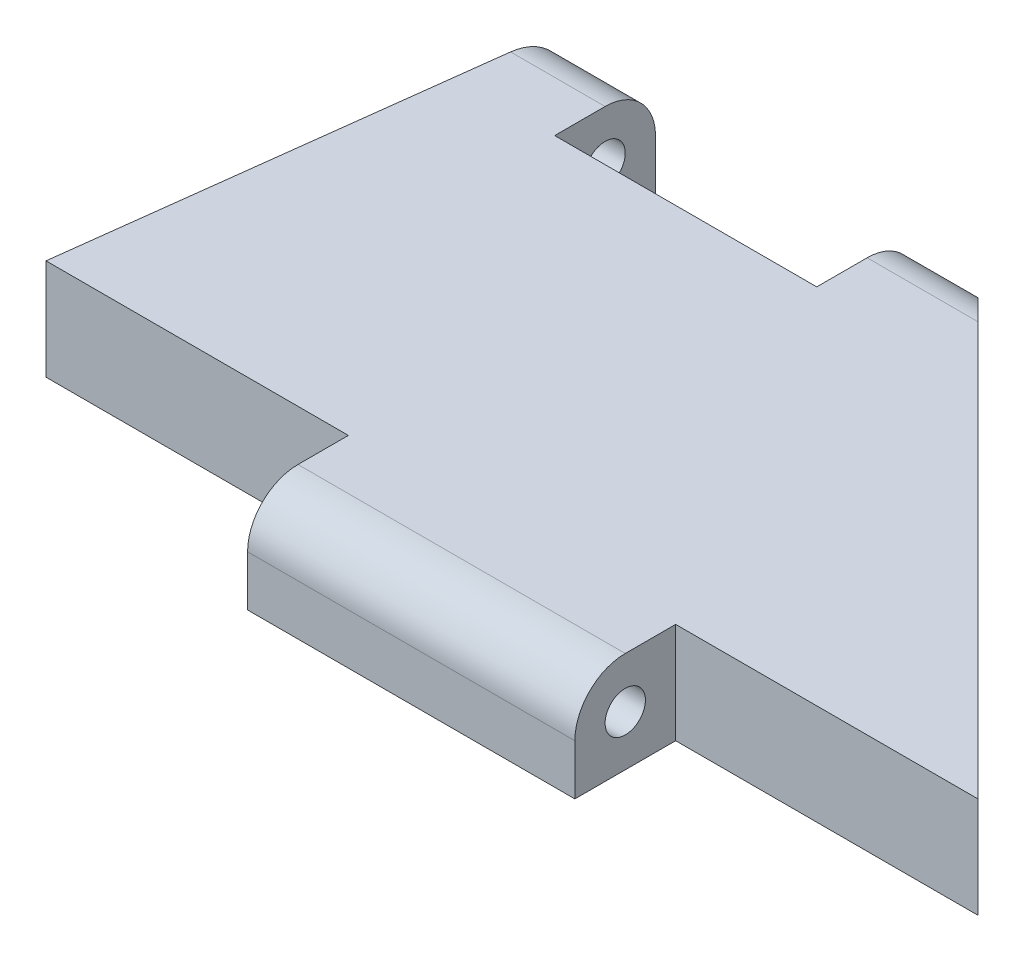
ISO-10303-21;
HEADER;
FILE_DESCRIPTION(('STEP AP214'),'2;1');
FILE_NAME('part.step','',(''),(''),'','','');
FILE_SCHEMA(('AUTOMOTIVE_DESIGN { 1 0 10303 214 1 1 1 1 }'));
ENDSEC;
DATA;
#1=APPLICATION_CONTEXT('core data for automotive mechanical design processes');
#2=APPLICATION_PROTOCOL_DEFINITION('international standard','automotive_design',2000,#1);
#3=PRODUCT_CONTEXT('',#1,'mechanical');
#4=PRODUCT('Part','Part','',(#3));
#5=PRODUCT_RELATED_PRODUCT_CATEGORY('part','',(#4));
#6=PRODUCT_DEFINITION_FORMATION('','',#4);
#7=PRODUCT_DEFINITION_CONTEXT('part definition',#1,'design');
#8=PRODUCT_DEFINITION('design','',#6,#7);
#9=PRODUCT_DEFINITION_SHAPE('','',#8);
#10=(LENGTH_UNIT() NAMED_UNIT(*) SI_UNIT(.MILLI.,.METRE.));
#11=(NAMED_UNIT(*) PLANE_ANGLE_UNIT() SI_UNIT($,.RADIAN.));
#12=(NAMED_UNIT(*) SI_UNIT($,.STERADIAN.) SOLID_ANGLE_UNIT());
#13=UNCERTAINTY_MEASURE_WITH_UNIT(LENGTH_MEASURE(1.E-05),#10,'distance_accuracy_value','');
#14=(GEOMETRIC_REPRESENTATION_CONTEXT(3) GLOBAL_UNCERTAINTY_ASSIGNED_CONTEXT((#13)) GLOBAL_UNIT_ASSIGNED_CONTEXT((#10,
#11,#12)) REPRESENTATION_CONTEXT('',''));
#15=CARTESIAN_POINT('',(0.,0.,0.));
#16=DIRECTION('',(0.,0.,1.));
#17=DIRECTION('',(1.,0.,0.));
#18=AXIS2_PLACEMENT_3D('',#15,#16,#17);
#19=CARTESIAN_POINT('',(-24.13,0.,-48.3095533280841));
#20=DIRECTION('',(0.,0.,-1.));
#21=DIRECTION('',(-1.,0.,0.));
#22=AXIS2_PLACEMENT_3D('',#19,#20,#21);
#23=PLANE('',#22);
#24=DIRECTION('',(1.,0.,0.));
#25=VECTOR('',#24,1.);
#26=CARTESIAN_POINT('',(-24.13,0.,-48.3095533280841));
#27=LINE('',#26,#25);
#28=CARTESIAN_POINT('',(-0.80600935182104,2.46489848294482E-13,-48.309553328084));
#29=VERTEX_POINT('',#28);
#30=CARTESIAN_POINT('',(3.00399064817896,0.,-48.3095533280841));
#31=VERTEX_POINT('',#30);
#32=EDGE_CURVE('E263',#29,#31,#27,.T.);
#33=ORIENTED_EDGE('',*,*,#32,.F.);
#34=DIRECTION('',(0.,-1.,0.));
#35=VECTOR('',#34,1.);
#36=CARTESIAN_POINT('',(-0.80600935182104,-1.08197813299747E-13,-48.309553328084));
#37=LINE('',#36,#35);
#38=CARTESIAN_POINT('',(-0.806009351821049,3.17499999999999,-48.309553328084));
#39=VERTEX_POINT('',#38);
#40=EDGE_CURVE('E242',#39,#29,#37,.T.);
#41=ORIENTED_EDGE('',*,*,#40,.F.);
#42=DIRECTION('',(1.,0.,0.));
#43=VECTOR('',#42,1.);
#44=CARTESIAN_POINT('',(-24.13,3.175,-48.3095533280841));
#45=LINE('',#44,#43);
#46=CARTESIAN_POINT('',(3.00399064817895,3.175,-48.3095533280841));
#47=VERTEX_POINT('',#46);
#48=EDGE_CURVE('E131',#39,#47,#45,.T.);
#49=ORIENTED_EDGE('',*,*,#48,.T.);
#50=DIRECTION('',(0.,1.,0.));
#51=VECTOR('',#50,1.);
#52=CARTESIAN_POINT('',(3.00399064817896,0.,-48.3095533280841));
#53=LINE('',#52,#51);
#54=EDGE_CURVE('E259',#31,#47,#53,.T.);
#55=ORIENTED_EDGE('',*,*,#54,.F.);
#56=EDGE_LOOP('',(#33,#41,#49,#55));
#57=FACE_BOUND('',#56,.T.);
#58=ADVANCED_FACE('F108',(#57),#23,.T.);
#59=CARTESIAN_POINT('',(-24.13,3.175,-45.1345533280841));
#60=DIRECTION('',(1.,0.,0.));
#61=DIRECTION('',(0.,0.,-1.));
#62=AXIS2_PLACEMENT_3D('',#59,#60,#61);
#63=CYLINDRICAL_SURFACE('',#62,3.175);
#64=ORIENTED_EDGE('',*,*,#48,.F.);
#65=CARTESIAN_POINT('',(-0.806009351821027,3.175,-45.1345533280841));
#66=DIRECTION('',(-1.,0.,0.));
#67=DIRECTION('',(0.,0.,1.));
#68=AXIS2_PLACEMENT_3D('',#65,#66,#67);
#69=CIRCLE('',#68,3.175);
#70=CARTESIAN_POINT('',(-0.806009351821006,6.35,-45.1345533280841));
#71=VERTEX_POINT('',#70);
#72=EDGE_CURVE('E116',#39,#71,#69,.F.);
#73=ORIENTED_EDGE('',*,*,#72,.T.);
#74=DIRECTION('',(1.,0.,0.));
#75=VECTOR('',#74,1.);
#76=CARTESIAN_POINT('',(-24.13,6.35,-45.1345533280841));
#77=LINE('',#76,#75);
#78=CARTESIAN_POINT('',(6.17899064817894,6.35,-45.1345533280841));
#79=VERTEX_POINT('',#78);
#80=EDGE_CURVE('E267',#71,#79,#77,.T.);
#81=ORIENTED_EDGE('',*,*,#80,.T.);
#82=CARTESIAN_POINT('',(6.17899064817895,3.175,-45.1345533280841));
#83=DIRECTION('',(-0.707106781186548,0.,0.707106781186547));
#84=DIRECTION('',(0.707106781186547,0.,0.707106781186548));
#85=AXIS2_PLACEMENT_3D('',#82,#83,#84);
#86=ELLIPSE('',#85,4.49012806053457,3.175);
#87=EDGE_CURVE('E338',#47,#79,#86,.F.);
#88=ORIENTED_EDGE('',*,*,#87,.F.);
#89=EDGE_LOOP('',(#64,#73,#81,#88));
#90=FACE_BOUND('',#89,.T.);
#91=ADVANCED_FACE('F342',(#90),#63,.T.);
#92=CARTESIAN_POINT('',(0.,6.35,0.));
#93=DIRECTION('',(0.,1.,0.));
#94=DIRECTION('',(0.,0.,1.));
#95=AXIS2_PLACEMENT_3D('',#92,#93,#94);
#96=PLANE('',#95);
#97=DIRECTION('',(0.,0.,-1.));
#98=VECTOR('',#97,1.);
#99=CARTESIAN_POINT('',(-17.3160093518207,6.34999999999988,1.06992989888327E-13));
#100=LINE('',#99,#98);
#101=CARTESIAN_POINT('',(-17.316009351821,6.34999999999979,-41.9595533280843));
#102=VERTEX_POINT('',#101);
#103=CARTESIAN_POINT('',(-17.316009351821,6.34999999999978,-45.1345533280841));
#104=VERTEX_POINT('',#103);
#105=EDGE_CURVE('E236',#102,#104,#100,.T.);
#106=ORIENTED_EDGE('',*,*,#105,.T.);
#107=CARTESIAN_POINT('',(-23.2715070293211,6.35,-45.1345533280841));
#108=VERTEX_POINT('',#107);
#109=EDGE_CURVE('E264',#108,#104,#77,.T.);
#110=ORIENTED_EDGE('',*,*,#109,.F.);
#111=DIRECTION('',(-0.123304512929953,0.,0.99236888156124));
#112=VECTOR('',#111,1.);
#113=CARTESIAN_POINT('',(-23.6660093518211,6.35,-41.9595533280841));
#114=LINE('',#113,#112);
#115=CARTESIAN_POINT('',(-26.5064260738208,6.35,-19.0995533280841));
#116=VERTEX_POINT('',#115);
#117=EDGE_CURVE('E320',#108,#116,#114,.T.);
#118=ORIENTED_EDGE('',*,*,#117,.T.);
#119=DIRECTION('',(-1.,0.,0.));
#120=VECTOR('',#119,1.);
#121=CARTESIAN_POINT('',(-7.4564260738208,6.35,-19.0995533280841));
#122=LINE('',#121,#120);
#123=CARTESIAN_POINT('',(-7.4564260738208,6.35,-19.0995533280841));
#124=VERTEX_POINT('',#123);
#125=EDGE_CURVE('E286',#124,#116,#122,.T.);
#126=ORIENTED_EDGE('',*,*,#125,.F.);
#127=DIRECTION('',(0.,0.,-1.));
#128=VECTOR('',#127,1.);
#129=CARTESIAN_POINT('',(-7.4564260738208,6.35,0.));
#130=LINE('',#129,#128);
#131=CARTESIAN_POINT('',(-7.4564260738208,6.35,-15.9245533280841));
#132=VERTEX_POINT('',#131);
#133=EDGE_CURVE('E273',#132,#124,#130,.T.);
#134=ORIENTED_EDGE('',*,*,#133,.F.);
#135=DIRECTION('',(-1.,0.,0.));
#136=VECTOR('',#135,1.);
#137=CARTESIAN_POINT('',(32.2139906481792,6.35,-15.9245533280841));
#138=LINE('',#137,#136);
#139=CARTESIAN_POINT('',(13.1639906481792,6.35,-15.9245533280841));
#140=VERTEX_POINT('',#139);
#141=EDGE_CURVE('E316',#140,#132,#138,.T.);
#142=ORIENTED_EDGE('',*,*,#141,.F.);
#143=DIRECTION('',(0.,0.,1.));
#144=VECTOR('',#143,1.);
#145=CARTESIAN_POINT('',(13.1639906481792,6.35,0.));
#146=LINE('',#145,#144);
#147=CARTESIAN_POINT('',(13.1639906481792,6.35,-19.0995533280841));
#148=VERTEX_POINT('',#147);
#149=EDGE_CURVE('E294',#148,#140,#146,.T.);
#150=ORIENTED_EDGE('',*,*,#149,.F.);
#151=DIRECTION('',(1.,0.,0.));
#152=VECTOR('',#151,1.);
#153=CARTESIAN_POINT('',(13.1639906481792,6.35,-19.0995533280841));
#154=LINE('',#153,#152);
#155=CARTESIAN_POINT('',(32.2139906481792,6.35,-19.0995533280841));
#156=VERTEX_POINT('',#155);
#157=EDGE_CURVE('E306',#148,#156,#154,.T.);
#158=ORIENTED_EDGE('',*,*,#157,.T.);
#159=DIRECTION('',(-0.707106781186551,0.,-0.707106781186544));
#160=VECTOR('',#159,1.);
#161=CARTESIAN_POINT('',(32.2139906481792,6.35,-19.0995533280841));
#162=LINE('',#161,#160);
#163=EDGE_CURVE('E323',#156,#79,#162,.T.);
#164=ORIENTED_EDGE('',*,*,#163,.T.);
#165=ORIENTED_EDGE('',*,*,#80,.F.);
#166=DIRECTION('',(0.,0.,-1.));
#167=VECTOR('',#166,1.);
#168=CARTESIAN_POINT('',(-0.806009351820723,6.34999999999994,0.));
#169=LINE('',#168,#167);
#170=CARTESIAN_POINT('',(-0.806009351821016,6.34999999999984,-41.9595533280844));
#171=VERTEX_POINT('',#170);
#172=EDGE_CURVE('E123',#171,#71,#169,.T.);
#173=ORIENTED_EDGE('',*,*,#172,.F.);
#174=DIRECTION('',(1.,0.,0.));
#175=VECTOR('',#174,1.);
#176=CARTESIAN_POINT('',(-17.316009351821,6.34999999999979,-41.9595533280843));
#177=LINE('',#176,#175);
#178=EDGE_CURVE('E228',#102,#171,#177,.T.);
#179=ORIENTED_EDGE('',*,*,#178,.F.);
#180=EDGE_LOOP('',(#106,#110,#118,#126,#134,#142,#150,#158,#164,#165,#173,#179));
#181=FACE_BOUND('',#180,.T.);
#182=ADVANCED_FACE('F345',(#181),#96,.T.);
#183=CARTESIAN_POINT('',(0.,0.,0.));
#184=DIRECTION('',(0.,1.,0.));
#185=DIRECTION('',(0.,0.,1.));
#186=AXIS2_PLACEMENT_3D('',#183,#184,#185);
#187=PLANE('',#186);
#188=CARTESIAN_POINT('',(-22.8770047068211,0.,-48.3095533280841));
#189=VERTEX_POINT('',#188);
#190=CARTESIAN_POINT('',(-17.316009351821,1.92366475844006E-13,-48.3095533280839));
#191=VERTEX_POINT('',#190);
#192=EDGE_CURVE('E241',#189,#191,#27,.T.);
#193=ORIENTED_EDGE('',*,*,#192,.T.);
#194=DIRECTION('',(0.,0.,-1.));
#195=VECTOR('',#194,1.);
#196=CARTESIAN_POINT('',(-17.3160093518207,0.,1.20870777696142E-13));
#197=LINE('',#196,#195);
#198=CARTESIAN_POINT('',(-17.316009351821,2.06244263651821E-13,-41.9595533280843));
#199=VERTEX_POINT('',#198);
#200=EDGE_CURVE('E233',#199,#191,#197,.T.);
#201=ORIENTED_EDGE('',*,*,#200,.F.);
#202=DIRECTION('',(1.,0.,0.));
#203=VECTOR('',#202,1.);
#204=CARTESIAN_POINT('',(-17.316009351821,2.06244263651821E-13,-41.9595533280843));
#205=LINE('',#204,#203);
#206=CARTESIAN_POINT('',(-0.806009351820995,2.60367636102297E-13,-41.9595533280844));
#207=VERTEX_POINT('',#206);
#208=EDGE_CURVE('E218',#199,#207,#205,.T.);
#209=ORIENTED_EDGE('',*,*,#208,.T.);
#210=DIRECTION('',(0.,0.,-1.));
#211=VECTOR('',#210,1.);
#212=CARTESIAN_POINT('',(-0.806009351820702,0.,0.));
#213=LINE('',#212,#211);
#214=EDGE_CURVE('E252',#207,#29,#213,.T.);
#215=ORIENTED_EDGE('',*,*,#214,.T.);
#216=ORIENTED_EDGE('',*,*,#32,.T.);
#217=DIRECTION('',(-0.707106781186551,0.,-0.707106781186544));
#218=VECTOR('',#217,1.);
#219=CARTESIAN_POINT('',(32.2139906481792,0.,-19.0995533280841));
#220=LINE('',#219,#218);
#221=CARTESIAN_POINT('',(32.2139906481792,0.,-19.0995533280841));
#222=VERTEX_POINT('',#221);
#223=EDGE_CURVE('E324',#222,#31,#220,.T.);
#224=ORIENTED_EDGE('',*,*,#223,.F.);
#225=DIRECTION('',(1.,0.,0.));
#226=VECTOR('',#225,1.);
#227=CARTESIAN_POINT('',(13.1639906481792,0.,-19.0995533280841));
#228=LINE('',#227,#226);
#229=CARTESIAN_POINT('',(13.1639906481792,0.,-19.0995533280841));
#230=VERTEX_POINT('',#229);
#231=EDGE_CURVE('E305',#230,#222,#228,.T.);
#232=ORIENTED_EDGE('',*,*,#231,.F.);
#233=DIRECTION('',(0.,0.,1.));
#234=VECTOR('',#233,1.);
#235=CARTESIAN_POINT('',(13.1639906481792,0.,0.));
#236=LINE('',#235,#234);
#237=CARTESIAN_POINT('',(13.1639906481792,0.,-12.7495533280841));
#238=VERTEX_POINT('',#237);
#239=EDGE_CURVE('E300',#230,#238,#236,.T.);
#240=ORIENTED_EDGE('',*,*,#239,.T.);
#241=DIRECTION('',(-1.,0.,0.));
#242=VECTOR('',#241,1.);
#243=CARTESIAN_POINT('',(32.2139906481792,0.,-12.7495533280841));
#244=LINE('',#243,#242);
#245=CARTESIAN_POINT('',(-7.4564260738208,0.,-12.7495533280841));
#246=VERTEX_POINT('',#245);
#247=EDGE_CURVE('E309',#238,#246,#244,.T.);
#248=ORIENTED_EDGE('',*,*,#247,.T.);
#249=DIRECTION('',(0.,0.,-1.));
#250=VECTOR('',#249,1.);
#251=CARTESIAN_POINT('',(-7.4564260738208,0.,0.));
#252=LINE('',#251,#250);
#253=CARTESIAN_POINT('',(-7.4564260738208,0.,-19.0995533280841));
#254=VERTEX_POINT('',#253);
#255=EDGE_CURVE('E278',#246,#254,#252,.T.);
#256=ORIENTED_EDGE('',*,*,#255,.T.);
#257=DIRECTION('',(-1.,0.,0.));
#258=VECTOR('',#257,1.);
#259=CARTESIAN_POINT('',(-7.4564260738208,0.,-19.0995533280841));
#260=LINE('',#259,#258);
#261=CARTESIAN_POINT('',(-26.5064260738208,0.,-19.0995533280841));
#262=VERTEX_POINT('',#261);
#263=EDGE_CURVE('E287',#254,#262,#260,.T.);
#264=ORIENTED_EDGE('',*,*,#263,.T.);
#265=DIRECTION('',(-0.123304512929953,0.,0.99236888156124));
#266=VECTOR('',#265,1.);
#267=CARTESIAN_POINT('',(-23.6660093518211,0.,-41.9595533280841));
#268=LINE('',#267,#266);
#269=EDGE_CURVE('E319',#189,#262,#268,.T.);
#270=ORIENTED_EDGE('',*,*,#269,.F.);
#271=EDGE_LOOP('',(#193,#201,#209,#215,#216,#224,#232,#240,#248,#256,#264,#270));
#272=FACE_BOUND('',#271,.T.);
#273=ADVANCED_FACE('F239',(#272),#187,.F.);
#274=CARTESIAN_POINT('',(32.2139906481792,3.175,-15.9245533280841));
#275=DIRECTION('',(-1.,0.,0.));
#276=DIRECTION('',(0.,0.,1.));
#277=AXIS2_PLACEMENT_3D('',#274,#275,#276);
#278=CYLINDRICAL_SURFACE('',#277,3.175);
#279=ORIENTED_EDGE('',*,*,#141,.T.);
#280=CARTESIAN_POINT('',(-7.4564260738208,3.175,-15.9245533280841));
#281=DIRECTION('',(1.,0.,0.));
#282=DIRECTION('',(0.,0.,-1.));
#283=AXIS2_PLACEMENT_3D('',#280,#281,#282);
#284=CIRCLE('',#283,3.175);
#285=CARTESIAN_POINT('',(-7.4564260738208,3.175,-12.7495533280841));
#286=VERTEX_POINT('',#285);
#287=EDGE_CURVE('E283',#132,#286,#284,.T.);
#288=ORIENTED_EDGE('',*,*,#287,.T.);
#289=DIRECTION('',(-1.,0.,0.));
#290=VECTOR('',#289,1.);
#291=CARTESIAN_POINT('',(32.2139906481792,3.175,-12.7495533280841));
#292=LINE('',#291,#290);
#293=CARTESIAN_POINT('',(13.1639906481792,3.175,-12.7495533280841));
#294=VERTEX_POINT('',#293);
#295=EDGE_CURVE('E313',#294,#286,#292,.T.);
#296=ORIENTED_EDGE('',*,*,#295,.F.);
#297=CARTESIAN_POINT('',(13.1639906481792,3.175,-15.9245533280841));
#298=DIRECTION('',(1.,0.,0.));
#299=DIRECTION('',(0.,0.,-1.));
#300=AXIS2_PLACEMENT_3D('',#297,#298,#299);
#301=CIRCLE('',#300,3.175);
#302=EDGE_CURVE('E296',#140,#294,#301,.T.);
#303=ORIENTED_EDGE('',*,*,#302,.F.);
#304=EDGE_LOOP('',(#279,#288,#296,#303));
#305=FACE_BOUND('',#304,.T.);
#306=ADVANCED_FACE('F408',(#305),#278,.T.);
#307=CARTESIAN_POINT('',(32.2139906481792,0.,-12.7495533280841));
#308=DIRECTION('',(0.,0.,1.));
#309=DIRECTION('',(1.,0.,0.));
#310=AXIS2_PLACEMENT_3D('',#307,#308,#309);
#311=PLANE('',#310);
#312=DIRECTION('',(0.,1.,0.));
#313=VECTOR('',#312,1.);
#314=CARTESIAN_POINT('',(-7.4564260738208,0.,-12.7495533280841));
#315=LINE('',#314,#313);
#316=EDGE_CURVE('E281',#246,#286,#315,.T.);
#317=ORIENTED_EDGE('',*,*,#316,.F.);
#318=ORIENTED_EDGE('',*,*,#247,.F.);
#319=DIRECTION('',(0.,-1.,0.));
#320=VECTOR('',#319,1.);
#321=CARTESIAN_POINT('',(13.1639906481792,0.,-12.7495533280841));
#322=LINE('',#321,#320);
#323=EDGE_CURVE('E298',#294,#238,#322,.T.);
#324=ORIENTED_EDGE('',*,*,#323,.F.);
#325=ORIENTED_EDGE('',*,*,#295,.T.);
#326=EDGE_LOOP('',(#317,#318,#324,#325));
#327=FACE_BOUND('',#326,.T.);
#328=ADVANCED_FACE('F403',(#327),#311,.T.);
#329=CARTESIAN_POINT('',(32.2139906481792,3.175,-15.9245533280841));
#330=DIRECTION('',(-1.,0.,0.));
#331=DIRECTION('',(0.,0.,1.));
#332=AXIS2_PLACEMENT_3D('',#329,#330,#331);
#333=CYLINDRICAL_SURFACE('',#332,1.27);
#334=CARTESIAN_POINT('',(-7.4564260738208,3.175,-15.9245533280841));
#335=DIRECTION('',(1.,0.,0.));
#336=DIRECTION('',(0.,0.,-1.));
#337=AXIS2_PLACEMENT_3D('',#334,#335,#336);
#338=CIRCLE('',#337,1.27);
#339=CARTESIAN_POINT('',(-7.4564260738208,3.175,-17.1945533280841));
#340=VERTEX_POINT('',#339);
#341=EDGE_CURVE('E262',#340,#340,#338,.T.);
#342=ORIENTED_EDGE('',*,*,#341,.F.);
#343=EDGE_LOOP('',(#342));
#344=FACE_BOUND('',#343,.T.);
#345=CARTESIAN_POINT('',(13.1639906481792,3.175,-15.9245533280841));
#346=DIRECTION('',(1.,0.,0.));
#347=DIRECTION('',(0.,0.,-1.));
#348=AXIS2_PLACEMENT_3D('',#345,#346,#347);
#349=CIRCLE('',#348,1.27);
#350=CARTESIAN_POINT('',(13.1639906481792,3.175,-17.1945533280841));
#351=VERTEX_POINT('',#350);
#352=EDGE_CURVE('E290',#351,#351,#349,.T.);
#353=ORIENTED_EDGE('',*,*,#352,.T.);
#354=EDGE_LOOP('',(#353));
#355=FACE_BOUND('',#354,.T.);
#356=ADVANCED_FACE('F425',(#344,#355),#333,.F.);
#357=CARTESIAN_POINT('',(-23.6660093518211,6.35,-41.9595533280841));
#358=DIRECTION('',(0.99236888156124,0.,0.123304512929953));
#359=DIRECTION('',(0.123304512929953,0.,-0.99236888156124));
#360=AXIS2_PLACEMENT_3D('',#357,#358,#359);
#361=PLANE('',#360);
#362=ORIENTED_EDGE('',*,*,#269,.T.);
#363=DIRECTION('',(0.,-1.,0.));
#364=VECTOR('',#363,1.);
#365=CARTESIAN_POINT('',(-26.5064260738208,6.35,-19.0995533280841));
#366=LINE('',#365,#364);
#367=EDGE_CURVE('E334',#116,#262,#366,.T.);
#368=ORIENTED_EDGE('',*,*,#367,.F.);
#369=ORIENTED_EDGE('',*,*,#117,.F.);
#370=CARTESIAN_POINT('',(-23.2715070293211,3.175,-45.1345533280841));
#371=DIRECTION('',(0.992368881561239,0.,0.12330451292996));
#372=DIRECTION('',(0.12330451292996,0.,-0.992368881561239));
#373=AXIS2_PLACEMENT_3D('',#370,#371,#372);
#374=ELLIPSE('',#373,3.19941511568253,3.175);
#375=CARTESIAN_POINT('',(-22.8770047068211,3.175,-48.3095533280841));
#376=VERTEX_POINT('',#375);
#377=EDGE_CURVE('E336',#108,#376,#374,.F.);
#378=ORIENTED_EDGE('',*,*,#377,.T.);
#379=DIRECTION('',(0.,-1.,0.));
#380=VECTOR('',#379,1.);
#381=CARTESIAN_POINT('',(-22.8770047068211,0.,-48.3095533280841));
#382=LINE('',#381,#380);
#383=EDGE_CURVE('E227',#376,#189,#382,.T.);
#384=ORIENTED_EDGE('',*,*,#383,.T.);
#385=EDGE_LOOP('',(#362,#368,#369,#378,#384));
#386=FACE_BOUND('',#385,.T.);
#387=ADVANCED_FACE('F110',(#386),#361,.F.);
#388=CARTESIAN_POINT('',(32.2139906481792,6.35,-19.0995533280841));
#389=DIRECTION('',(-0.707106781186544,0.,0.707106781186551));
#390=DIRECTION('',(0.707106781186551,0.,0.707106781186544));
#391=AXIS2_PLACEMENT_3D('',#388,#389,#390);
#392=PLANE('',#391);
#393=ORIENTED_EDGE('',*,*,#223,.T.);
#394=ORIENTED_EDGE('',*,*,#54,.T.);
#395=ORIENTED_EDGE('',*,*,#87,.T.);
#396=ORIENTED_EDGE('',*,*,#163,.F.);
#397=DIRECTION('',(0.,-1.,0.));
#398=VECTOR('',#397,1.);
#399=CARTESIAN_POINT('',(32.2139906481792,6.35,-19.0995533280841));
#400=LINE('',#399,#398);
#401=EDGE_CURVE('E327',#156,#222,#400,.T.);
#402=ORIENTED_EDGE('',*,*,#401,.T.);
#403=EDGE_LOOP('',(#393,#394,#395,#396,#402));
#404=FACE_BOUND('',#403,.T.);
#405=ADVANCED_FACE('F349',(#404),#392,.F.);
#406=CARTESIAN_POINT('',(13.1639906481792,0.,-19.0995533280841));
#407=DIRECTION('',(0.,0.,1.));
#408=DIRECTION('',(1.,0.,0.));
#409=AXIS2_PLACEMENT_3D('',#406,#407,#408);
#410=PLANE('',#409);
#411=ORIENTED_EDGE('',*,*,#401,.F.);
#412=ORIENTED_EDGE('',*,*,#157,.F.);
#413=DIRECTION('',(0.,-1.,0.));
#414=VECTOR('',#413,1.);
#415=CARTESIAN_POINT('',(13.1639906481792,0.,-19.0995533280841));
#416=LINE('',#415,#414);
#417=EDGE_CURVE('E303',#148,#230,#416,.T.);
#418=ORIENTED_EDGE('',*,*,#417,.T.);
#419=ORIENTED_EDGE('',*,*,#231,.T.);
#420=EDGE_LOOP('',(#411,#412,#418,#419));
#421=FACE_BOUND('',#420,.T.);
#422=ADVANCED_FACE('F415',(#421),#410,.T.);
#423=CARTESIAN_POINT('',(13.1639906481792,3.175,-15.9245533280841));
#424=DIRECTION('',(1.,0.,0.));
#425=DIRECTION('',(0.,0.,-1.));
#426=AXIS2_PLACEMENT_3D('',#423,#424,#425);
#427=PLANE('',#426);
#428=ORIENTED_EDGE('',*,*,#352,.F.);
#429=EDGE_LOOP('',(#428));
#430=FACE_BOUND('',#429,.T.);
#431=ORIENTED_EDGE('',*,*,#149,.T.);
#432=ORIENTED_EDGE('',*,*,#302,.T.);
#433=ORIENTED_EDGE('',*,*,#323,.T.);
#434=ORIENTED_EDGE('',*,*,#239,.F.);
#435=ORIENTED_EDGE('',*,*,#417,.F.);
#436=EDGE_LOOP('',(#431,#432,#433,#434,#435));
#437=FACE_BOUND('',#436,.T.);
#438=ADVANCED_FACE('F412',(#430,#437),#427,.T.);
#439=CARTESIAN_POINT('',(-7.4564260738208,3.175,-15.9245533280841));
#440=DIRECTION('',(1.,0.,0.));
#441=DIRECTION('',(0.,0.,-1.));
#442=AXIS2_PLACEMENT_3D('',#439,#440,#441);
#443=PLANE('',#442);
#444=ORIENTED_EDGE('',*,*,#133,.T.);
#445=DIRECTION('',(0.,1.,0.));
#446=VECTOR('',#445,1.);
#447=CARTESIAN_POINT('',(-7.4564260738208,0.,-19.0995533280841));
#448=LINE('',#447,#446);
#449=EDGE_CURVE('E276',#254,#124,#448,.T.);
#450=ORIENTED_EDGE('',*,*,#449,.F.);
#451=ORIENTED_EDGE('',*,*,#255,.F.);
#452=ORIENTED_EDGE('',*,*,#316,.T.);
#453=ORIENTED_EDGE('',*,*,#287,.F.);
#454=EDGE_LOOP('',(#444,#450,#451,#452,#453));
#455=FACE_BOUND('',#454,.T.);
#456=ORIENTED_EDGE('',*,*,#341,.T.);
#457=EDGE_LOOP('',(#456));
#458=FACE_BOUND('',#457,.T.);
#459=ADVANCED_FACE('F385',(#455,#458),#443,.F.);
#460=CARTESIAN_POINT('',(-7.4564260738208,0.,-19.0995533280841));
#461=DIRECTION('',(0.,0.,1.));
#462=DIRECTION('',(1.,0.,0.));
#463=AXIS2_PLACEMENT_3D('',#460,#461,#462);
#464=PLANE('',#463);
#465=ORIENTED_EDGE('',*,*,#367,.T.);
#466=ORIENTED_EDGE('',*,*,#263,.F.);
#467=ORIENTED_EDGE('',*,*,#449,.T.);
#468=ORIENTED_EDGE('',*,*,#125,.T.);
#469=EDGE_LOOP('',(#465,#466,#467,#468));
#470=FACE_BOUND('',#469,.T.);
#471=ADVANCED_FACE('F378',(#470),#464,.T.);
#472=DIRECTION('',(0.,-1.,0.));
#473=VECTOR('',#472,1.);
#474=CARTESIAN_POINT('',(-17.316009351821,-1.62321185750223E-13,-48.3095533280839));
#475=LINE('',#474,#473);
#476=CARTESIAN_POINT('',(-17.316009351821,3.17499999999999,-48.3095533280839));
#477=VERTEX_POINT('',#476);
#478=EDGE_CURVE('E250',#477,#191,#475,.T.);
#479=ORIENTED_EDGE('',*,*,#478,.T.);
#480=ORIENTED_EDGE('',*,*,#192,.F.);
#481=ORIENTED_EDGE('',*,*,#383,.F.);
#482=EDGE_CURVE('E268',#376,#477,#45,.T.);
#483=ORIENTED_EDGE('',*,*,#482,.T.);
#484=EDGE_LOOP('',(#479,#480,#481,#483));
#485=FACE_BOUND('',#484,.T.);
#486=ADVANCED_FACE('F370',(#485),#23,.T.);
#487=CARTESIAN_POINT('',(-17.316009351821,3.175,-45.1345533280841));
#488=DIRECTION('',(-1.,0.,0.));
#489=DIRECTION('',(0.,0.,1.));
#490=AXIS2_PLACEMENT_3D('',#487,#488,#489);
#491=CIRCLE('',#490,3.175);
#492=EDGE_CURVE('E12',#477,#104,#491,.F.);
#493=ORIENTED_EDGE('',*,*,#492,.F.);
#494=ORIENTED_EDGE('',*,*,#482,.F.);
#495=ORIENTED_EDGE('',*,*,#377,.F.);
#496=ORIENTED_EDGE('',*,*,#109,.T.);
#497=EDGE_LOOP('',(#493,#494,#495,#496));
#498=FACE_BOUND('',#497,.T.);
#499=ADVANCED_FACE('F375',(#498),#63,.T.);
#500=CARTESIAN_POINT('',(-17.316009351821,-1.48443397942409E-13,-41.9595533280843));
#501=DIRECTION('',(0.,0.,1.));
#502=DIRECTION('',(1.,0.,0.));
#503=AXIS2_PLACEMENT_3D('',#500,#501,#502);
#504=PLANE('',#503);
#505=DIRECTION('',(0.,-1.,0.));
#506=VECTOR('',#505,1.);
#507=CARTESIAN_POINT('',(-0.806009351820995,0.,-41.9595533280844));
#508=LINE('',#507,#506);
#509=EDGE_CURVE('E223',#171,#207,#508,.T.);
#510=ORIENTED_EDGE('',*,*,#509,.T.);
#511=ORIENTED_EDGE('',*,*,#208,.F.);
#512=DIRECTION('',(0.,-1.,0.));
#513=VECTOR('',#512,1.);
#514=CARTESIAN_POINT('',(-17.316009351821,-1.48443397942409E-13,-41.9595533280843));
#515=LINE('',#514,#513);
#516=EDGE_CURVE('E221',#102,#199,#515,.T.);
#517=ORIENTED_EDGE('',*,*,#516,.F.);
#518=ORIENTED_EDGE('',*,*,#178,.T.);
#519=EDGE_LOOP('',(#510,#511,#517,#518));
#520=FACE_BOUND('',#519,.T.);
#521=ADVANCED_FACE('F220',(#520),#504,.F.);
#522=CARTESIAN_POINT('',(-17.3160093518207,0.,1.20870777696142E-13));
#523=DIRECTION('',(-1.,0.,0.));
#524=DIRECTION('',(0.,0.,1.));
#525=AXIS2_PLACEMENT_3D('',#522,#523,#524);
#526=PLANE('',#525);
#527=ORIENTED_EDGE('',*,*,#492,.T.);
#528=ORIENTED_EDGE('',*,*,#105,.F.);
#529=ORIENTED_EDGE('',*,*,#516,.T.);
#530=ORIENTED_EDGE('',*,*,#200,.T.);
#531=ORIENTED_EDGE('',*,*,#478,.F.);
#532=EDGE_LOOP('',(#527,#528,#529,#530,#531));
#533=FACE_BOUND('',#532,.T.);
#534=CARTESIAN_POINT('',(-17.316009351821,3.17499999999992,-45.1345533280839));
#535=DIRECTION('',(-1.,0.,0.));
#536=DIRECTION('',(0.,0.,1.));
#537=AXIS2_PLACEMENT_3D('',#534,#535,#536);
#538=CIRCLE('',#537,1.27);
#539=CARTESIAN_POINT('',(-17.316009351821,3.17499999999992,-43.8645533280839));
#540=VERTEX_POINT('',#539);
#541=EDGE_CURVE('E246',#540,#540,#538,.F.);
#542=ORIENTED_EDGE('',*,*,#541,.F.);
#543=EDGE_LOOP('',(#542));
#544=FACE_BOUND('',#543,.T.);
#545=ADVANCED_FACE('F231',(#533,#544),#526,.F.);
#546=CARTESIAN_POINT('',(-0.806009351820702,0.,0.));
#547=DIRECTION('',(-1.,0.,0.));
#548=DIRECTION('',(0.,0.,1.));
#549=AXIS2_PLACEMENT_3D('',#546,#547,#548);
#550=PLANE('',#549);
#551=CARTESIAN_POINT('',(-0.806009351821027,3.17499999999998,-45.134553328084));
#552=DIRECTION('',(-1.,0.,0.));
#553=DIRECTION('',(0.,0.,1.));
#554=AXIS2_PLACEMENT_3D('',#551,#552,#553);
#555=CIRCLE('',#554,1.27);
#556=CARTESIAN_POINT('',(-0.806009351821018,3.17499999999998,-43.864553328084));
#557=VERTEX_POINT('',#556);
#558=EDGE_CURVE('E581',#557,#557,#555,.F.);
#559=ORIENTED_EDGE('',*,*,#558,.T.);
#560=EDGE_LOOP('',(#559));
#561=FACE_BOUND('',#560,.T.);
#562=ORIENTED_EDGE('',*,*,#40,.T.);
#563=ORIENTED_EDGE('',*,*,#214,.F.);
#564=ORIENTED_EDGE('',*,*,#509,.F.);
#565=ORIENTED_EDGE('',*,*,#172,.T.);
#566=ORIENTED_EDGE('',*,*,#72,.F.);
#567=EDGE_LOOP('',(#562,#563,#564,#565,#566));
#568=FACE_BOUND('',#567,.T.);
#569=ADVANCED_FACE('F353',(#561,#568),#550,.T.);
#570=CARTESIAN_POINT('',(3.0039906481793,0.,0.));
#571=DIRECTION('',(-1.,0.,0.));
#572=DIRECTION('',(0.,0.,1.));
#573=AXIS2_PLACEMENT_3D('',#570,#571,#572);
#574=PLANE('',#573);
#575=CARTESIAN_POINT('',(3.00399064817897,3.17499999999999,-45.1345533280841));
#576=DIRECTION('',(-1.,0.,0.));
#577=DIRECTION('',(0.,0.,1.));
#578=AXIS2_PLACEMENT_3D('',#575,#576,#577);
#579=CIRCLE('',#578,1.27);
#580=CARTESIAN_POINT('',(3.00399064817898,3.17499999999999,-43.8645533280841));
#581=VERTEX_POINT('',#580);
#582=EDGE_CURVE('E582',#581,#581,#579,.T.);
#583=ORIENTED_EDGE('',*,*,#582,.T.);
#584=EDGE_LOOP('',(#583));
#585=FACE_BOUND('',#584,.T.);
#586=ADVANCED_FACE('F355',(#585),#574,.T.);
#587=CARTESIAN_POINT('',(-19.856009351821,3.17499999999991,-45.1345533280839));
#588=DIRECTION('',(1.,0.,0.));
#589=DIRECTION('',(0.,0.,-1.));
#590=AXIS2_PLACEMENT_3D('',#587,#588,#589);
#591=CYLINDRICAL_SURFACE('',#590,1.27);
#592=ORIENTED_EDGE('',*,*,#558,.F.);
#593=EDGE_LOOP('',(#592));
#594=FACE_BOUND('',#593,.T.);
#595=ORIENTED_EDGE('',*,*,#582,.F.);
#596=EDGE_LOOP('',(#595));
#597=FACE_BOUND('',#596,.T.);
#598=ADVANCED_FACE('F362',(#594,#597),#591,.F.);
#599=CARTESIAN_POINT('',(-19.856009351821,3.17499999999991,-45.1345533280839));
#600=DIRECTION('',(-1.,0.,0.));
#601=DIRECTION('',(0.,0.,1.));
#602=AXIS2_PLACEMENT_3D('',#599,#600,#601);
#603=CIRCLE('',#602,1.27);
#604=CARTESIAN_POINT('',(-19.856009351821,3.17499999999991,-43.8645533280839));
#605=VERTEX_POINT('',#604);
#606=EDGE_CURVE('E580',#605,#605,#603,.T.);
#607=ORIENTED_EDGE('',*,*,#606,.T.);
#608=EDGE_LOOP('',(#607));
#609=FACE_BOUND('',#608,.T.);
#610=ORIENTED_EDGE('',*,*,#541,.T.);
#611=EDGE_LOOP('',(#610));
#612=FACE_BOUND('',#611,.T.);
#613=ADVANCED_FACE('F555',(#609,#612),#591,.F.);
#614=CARTESIAN_POINT('',(-19.8560093518207,0.,1.38607502897465E-13));
#615=DIRECTION('',(-1.,0.,0.));
#616=DIRECTION('',(0.,0.,1.));
#617=AXIS2_PLACEMENT_3D('',#614,#615,#616);
#618=PLANE('',#617);
#619=ORIENTED_EDGE('',*,*,#606,.F.);
#620=EDGE_LOOP('',(#619));
#621=FACE_BOUND('',#620,.T.);
#622=ADVANCED_FACE('F565',(#621),#618,.F.);
#623=CLOSED_SHELL('',(#58,#91,#182,#273,#306,#328,#356,#387,#405,#422,#438,#459,#471,#486,#499,
#521,#545,#569,#586,#598,#613,#622));
#624=MANIFOLD_SOLID_BREP('B2',#623);
#625=ADVANCED_BREP_SHAPE_REPRESENTATION('',(#18,#624),#14);
#626=SHAPE_DEFINITION_REPRESENTATION(#9,#625);
ENDSEC;
END-ISO-10303-21;
